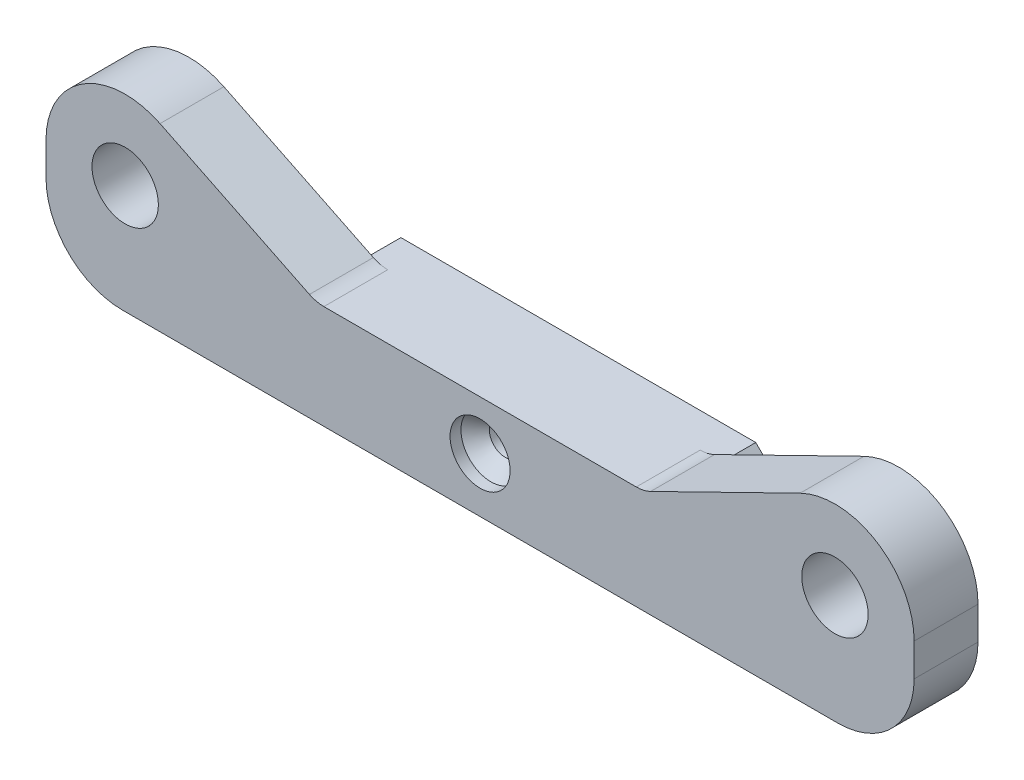
ISO-10303-21;
HEADER;
FILE_DESCRIPTION(('STEP AP214'),'2;1');
FILE_NAME('part.step','',(''),(''),'','','');
FILE_SCHEMA(('AUTOMOTIVE_DESIGN { 1 0 10303 214 1 1 1 1 }'));
ENDSEC;
DATA;
#1=APPLICATION_CONTEXT('core data for automotive mechanical design processes');
#2=APPLICATION_PROTOCOL_DEFINITION('international standard','automotive_design',2000,#1);
#3=PRODUCT_CONTEXT('',#1,'mechanical');
#4=PRODUCT('Part','Part','',(#3));
#5=PRODUCT_RELATED_PRODUCT_CATEGORY('part','',(#4));
#6=PRODUCT_DEFINITION_FORMATION('','',#4);
#7=PRODUCT_DEFINITION_CONTEXT('part definition',#1,'design');
#8=PRODUCT_DEFINITION('design','',#6,#7);
#9=PRODUCT_DEFINITION_SHAPE('','',#8);
#10=(LENGTH_UNIT() NAMED_UNIT(*) SI_UNIT(.MILLI.,.METRE.));
#11=(NAMED_UNIT(*) PLANE_ANGLE_UNIT() SI_UNIT($,.RADIAN.));
#12=(NAMED_UNIT(*) SI_UNIT($,.STERADIAN.) SOLID_ANGLE_UNIT());
#13=UNCERTAINTY_MEASURE_WITH_UNIT(LENGTH_MEASURE(1.E-05),#10,'distance_accuracy_value','');
#14=(GEOMETRIC_REPRESENTATION_CONTEXT(3) GLOBAL_UNCERTAINTY_ASSIGNED_CONTEXT((#13)) GLOBAL_UNIT_ASSIGNED_CONTEXT((#10,
#11,#12)) REPRESENTATION_CONTEXT('',''));
#15=CARTESIAN_POINT('',(0.,0.,0.));
#16=DIRECTION('',(0.,0.,1.));
#17=DIRECTION('',(1.,0.,0.));
#18=AXIS2_PLACEMENT_3D('',#15,#16,#17);
#19=CARTESIAN_POINT('',(-15.,0.,9.));
#20=DIRECTION('',(0.,0.,1.));
#21=DIRECTION('',(1.,0.,0.));
#22=AXIS2_PLACEMENT_3D('',#19,#20,#21);
#23=CYLINDRICAL_SURFACE('',#22,0.999999999999994);
#24=CARTESIAN_POINT('',(-15.,0.,0.));
#25=DIRECTION('',(0.,0.,-1.));
#26=DIRECTION('',(-1.,0.,0.));
#27=AXIS2_PLACEMENT_3D('',#24,#25,#26);
#28=CIRCLE('',#27,0.999999999999994);
#29=CARTESIAN_POINT('',(-16.,0.,0.));
#30=VERTEX_POINT('',#29);
#31=EDGE_CURVE('E260',#30,#30,#28,.T.);
#32=ORIENTED_EDGE('',*,*,#31,.T.);
#33=EDGE_LOOP('',(#32));
#34=FACE_BOUND('',#33,.T.);
#35=CARTESIAN_POINT('',(-15.,0.,7.));
#36=DIRECTION('',(0.,0.,1.));
#37=DIRECTION('',(1.,0.,0.));
#38=AXIS2_PLACEMENT_3D('',#35,#36,#37);
#39=CIRCLE('',#38,0.999999999999994);
#40=CARTESIAN_POINT('',(-14.,0.,7.));
#41=VERTEX_POINT('',#40);
#42=EDGE_CURVE('E457',#41,#41,#39,.F.);
#43=ORIENTED_EDGE('',*,*,#42,.F.);
#44=EDGE_LOOP('',(#43));
#45=FACE_BOUND('',#44,.T.);
#46=ADVANCED_FACE('F39',(#34,#45),#23,.F.);
#47=CARTESIAN_POINT('',(-32.5,5.,-17.3560966544099));
#48=DIRECTION('',(0.,0.,1.));
#49=DIRECTION('',(1.,0.,0.));
#50=AXIS2_PLACEMENT_3D('',#47,#48,#49);
#51=CYLINDRICAL_SURFACE('',#50,7.25000000000001);
#52=DIRECTION('',(0.,0.,-1.));
#53=VECTOR('',#52,1.);
#54=CARTESIAN_POINT('',(-39.75,4.99999999999995,19.0498756211209));
#55=LINE('',#54,#53);
#56=CARTESIAN_POINT('',(-39.75,4.99999999999995,9.));
#57=VERTEX_POINT('',#56);
#58=CARTESIAN_POINT('',(-39.75,4.99999999999995,3.15000000000003));
#59=VERTEX_POINT('',#58);
#60=EDGE_CURVE('E191',#57,#59,#55,.T.);
#61=ORIENTED_EDGE('',*,*,#60,.F.);
#62=CARTESIAN_POINT('',(-32.5,5.,9.));
#63=DIRECTION('',(0.,0.,1.));
#64=DIRECTION('',(1.,0.,0.));
#65=AXIS2_PLACEMENT_3D('',#62,#63,#64);
#66=CIRCLE('',#65,7.25000000000001);
#67=CARTESIAN_POINT('',(-29.3104090214584,11.5106842489562,9.));
#68=VERTEX_POINT('',#67);
#69=EDGE_CURVE('E204',#68,#57,#66,.T.);
#70=ORIENTED_EDGE('',*,*,#69,.F.);
#71=DIRECTION('',(0.,0.,-1.));
#72=VECTOR('',#71,1.);
#73=CARTESIAN_POINT('',(-29.3104090214584,11.5106842489562,24.9354165304833));
#74=LINE('',#73,#72);
#75=CARTESIAN_POINT('',(-29.3104090214584,11.5106842489562,3.15));
#76=VERTEX_POINT('',#75);
#77=EDGE_CURVE('E202',#68,#76,#74,.T.);
#78=ORIENTED_EDGE('',*,*,#77,.T.);
#79=CARTESIAN_POINT('',(-32.5,5.,3.15));
#80=DIRECTION('',(0.,0.,1.));
#81=DIRECTION('',(1.,0.,0.));
#82=AXIS2_PLACEMENT_3D('',#79,#80,#81);
#83=CIRCLE('',#82,7.25000000000001);
#84=EDGE_CURVE('E183',#59,#76,#83,.F.);
#85=ORIENTED_EDGE('',*,*,#84,.F.);
#86=EDGE_LOOP('',(#61,#70,#78,#85));
#87=FACE_BOUND('',#86,.T.);
#88=ADVANCED_FACE('F200',(#87),#51,.T.);
#89=CARTESIAN_POINT('',(38.75,-3.50000000000001,3.14999999999999));
#90=DIRECTION('',(0.,0.,1.));
#91=DIRECTION('',(1.,0.,0.));
#92=AXIS2_PLACEMENT_3D('',#89,#90,#91);
#93=PLANE('',#92);
#94=DIRECTION('',(0.,-1.,0.));
#95=VECTOR('',#94,1.);
#96=CARTESIAN_POINT('',(39.75,4.99999999999995,3.14999999999999));
#97=LINE('',#96,#95);
#98=CARTESIAN_POINT('',(39.75,4.99999999999999,3.15));
#99=VERTEX_POINT('',#98);
#100=CARTESIAN_POINT('',(39.75,2.,3.14999999999999));
#101=VERTEX_POINT('',#100);
#102=EDGE_CURVE('E197',#99,#101,#97,.T.);
#103=ORIENTED_EDGE('',*,*,#102,.T.);
#104=CARTESIAN_POINT('',(32.75,2.,3.14999999999999));
#105=DIRECTION('',(0.,0.,1.));
#106=DIRECTION('',(1.,0.,0.));
#107=AXIS2_PLACEMENT_3D('',#104,#105,#106);
#108=CIRCLE('',#107,7.);
#109=CARTESIAN_POINT('',(32.75,-5.,3.14999999999999));
#110=VERTEX_POINT('',#109);
#111=EDGE_CURVE('E12',#101,#110,#108,.F.);
#112=ORIENTED_EDGE('',*,*,#111,.T.);
#113=DIRECTION('',(1.,0.,0.));
#114=VECTOR('',#113,1.);
#115=CARTESIAN_POINT('',(18.75,-5.,3.15));
#116=LINE('',#115,#114);
#117=CARTESIAN_POINT('',(16.25,-5.,3.15));
#118=VERTEX_POINT('',#117);
#119=EDGE_CURVE('E374',#118,#110,#116,.T.);
#120=ORIENTED_EDGE('',*,*,#119,.F.);
#121=DIRECTION('',(0.707106781186546,0.707106781186549,0.));
#122=VECTOR('',#121,1.);
#123=CARTESIAN_POINT('',(28.2499999999999,7.,3.14999999999999));
#124=LINE('',#123,#122);
#125=CARTESIAN_POINT('',(18.75,-2.49999999999998,3.15));
#126=VERTEX_POINT('',#125);
#127=EDGE_CURVE('E387',#118,#126,#124,.T.);
#128=ORIENTED_EDGE('',*,*,#127,.T.);
#129=DIRECTION('',(0.,1.,0.));
#130=VECTOR('',#129,1.);
#131=CARTESIAN_POINT('',(18.75,-3.50000000000001,3.15));
#132=LINE('',#131,#130);
#133=CARTESIAN_POINT('',(18.75,2.,3.15));
#134=VERTEX_POINT('',#133);
#135=EDGE_CURVE('E404',#126,#134,#132,.T.);
#136=ORIENTED_EDGE('',*,*,#135,.T.);
#137=DIRECTION('',(-0.707106781186546,0.707106781186549,0.));
#138=VECTOR('',#137,1.);
#139=CARTESIAN_POINT('',(31.5,-10.75,3.14999999999999));
#140=LINE('',#139,#138);
#141=CARTESIAN_POINT('',(16.25,4.5,3.15000000000001));
#142=VERTEX_POINT('',#141);
#143=EDGE_CURVE('E396',#134,#142,#140,.T.);
#144=ORIENTED_EDGE('',*,*,#143,.T.);
#145=DIRECTION('',(-1.,0.,0.));
#146=VECTOR('',#145,1.);
#147=CARTESIAN_POINT('',(15.,4.5,3.15000000000001));
#148=LINE('',#147,#146);
#149=CARTESIAN_POINT('',(14.3046295691037,4.5,3.15000000000001));
#150=VERTEX_POINT('',#149);
#151=EDGE_CURVE('E303',#142,#150,#148,.T.);
#152=ORIENTED_EDGE('',*,*,#151,.T.);
#153=CARTESIAN_POINT('',(14.3046295691037,7.5,3.15));
#154=DIRECTION('',(0.,0.,1.));
#155=DIRECTION('',(1.,0.,0.));
#156=AXIS2_PLACEMENT_3D('',#153,#154,#155);
#157=CIRCLE('',#156,3.);
#158=CARTESIAN_POINT('',(15.624460318845,4.80592375905262,3.15000000000001));
#159=VERTEX_POINT('',#158);
#160=EDGE_CURVE('E289',#150,#159,#157,.T.);
#161=ORIENTED_EDGE('',*,*,#160,.T.);
#162=DIRECTION('',(0.898025413649127,0.439943583247118,0.));
#163=VECTOR('',#162,1.);
#164=CARTESIAN_POINT('',(29.3104090214584,11.5106842489562,3.15000000000002));
#165=LINE('',#164,#163);
#166=CARTESIAN_POINT('',(29.3104090214584,11.5106842489562,3.15000000000002));
#167=VERTEX_POINT('',#166);
#168=EDGE_CURVE('E299',#159,#167,#165,.T.);
#169=ORIENTED_EDGE('',*,*,#168,.T.);
#170=CARTESIAN_POINT('',(32.5,5.,3.15));
#171=DIRECTION('',(0.,0.,1.));
#172=DIRECTION('',(1.,0.,0.));
#173=AXIS2_PLACEMENT_3D('',#170,#171,#172);
#174=CIRCLE('',#173,7.25000000000001);
#175=EDGE_CURVE('E209',#167,#99,#174,.F.);
#176=ORIENTED_EDGE('',*,*,#175,.T.);
#177=EDGE_LOOP('',(#103,#112,#120,#128,#136,#144,#152,#161,#169,#176));
#178=FACE_BOUND('',#177,.T.);
#179=CARTESIAN_POINT('',(32.5,5.,3.14999999999999));
#180=DIRECTION('',(0.,0.,1.));
#181=DIRECTION('',(1.,0.,0.));
#182=AXIS2_PLACEMENT_3D('',#179,#180,#181);
#183=CIRCLE('',#182,3.04);
#184=CARTESIAN_POINT('',(35.54,5.,3.14999999999999));
#185=VERTEX_POINT('',#184);
#186=EDGE_CURVE('E408',#185,#185,#183,.F.);
#187=ORIENTED_EDGE('',*,*,#186,.F.);
#188=EDGE_LOOP('',(#187));
#189=FACE_BOUND('',#188,.T.);
#190=ADVANCED_FACE('F453',(#178,#189),#93,.F.);
#191=CARTESIAN_POINT('',(-38.75,3.49999999999999,9.));
#192=DIRECTION('',(0.,0.,1.));
#193=DIRECTION('',(1.,0.,0.));
#194=AXIS2_PLACEMENT_3D('',#191,#192,#193);
#195=PLANE('',#194);
#196=DIRECTION('',(0.,1.,0.));
#197=VECTOR('',#196,1.);
#198=CARTESIAN_POINT('',(-39.75,4.99999999999995,9.));
#199=LINE('',#198,#197);
#200=CARTESIAN_POINT('',(-39.75,2.,9.));
#201=VERTEX_POINT('',#200);
#202=EDGE_CURVE('E188',#201,#57,#199,.T.);
#203=ORIENTED_EDGE('',*,*,#202,.F.);
#204=CARTESIAN_POINT('',(-32.75,2.,9.));
#205=DIRECTION('',(0.,0.,1.));
#206=DIRECTION('',(1.,0.,0.));
#207=AXIS2_PLACEMENT_3D('',#204,#205,#206);
#208=CIRCLE('',#207,7.);
#209=CARTESIAN_POINT('',(-32.75,-5.,9.));
#210=VERTEX_POINT('',#209);
#211=EDGE_CURVE('E466',#201,#210,#208,.T.);
#212=ORIENTED_EDGE('',*,*,#211,.T.);
#213=DIRECTION('',(-1.,0.,0.));
#214=VECTOR('',#213,1.);
#215=CARTESIAN_POINT('',(38.75,-5.,9.));
#216=LINE('',#215,#214);
#217=CARTESIAN_POINT('',(32.75,-5.,9.));
#218=VERTEX_POINT('',#217);
#219=EDGE_CURVE('E249',#218,#210,#216,.T.);
#220=ORIENTED_EDGE('',*,*,#219,.F.);
#221=CARTESIAN_POINT('',(32.75,2.,9.));
#222=DIRECTION('',(0.,0.,1.));
#223=DIRECTION('',(1.,0.,0.));
#224=AXIS2_PLACEMENT_3D('',#221,#222,#223);
#225=CIRCLE('',#224,7.);
#226=CARTESIAN_POINT('',(39.75,2.,9.));
#227=VERTEX_POINT('',#226);
#228=EDGE_CURVE('E60',#218,#227,#225,.T.);
#229=ORIENTED_EDGE('',*,*,#228,.T.);
#230=DIRECTION('',(0.,-1.,0.));
#231=VECTOR('',#230,1.);
#232=CARTESIAN_POINT('',(39.75,4.99999999999995,9.));
#233=LINE('',#232,#231);
#234=CARTESIAN_POINT('',(39.75,4.99999999999995,9.));
#235=VERTEX_POINT('',#234);
#236=EDGE_CURVE('E321',#235,#227,#233,.T.);
#237=ORIENTED_EDGE('',*,*,#236,.F.);
#238=CARTESIAN_POINT('',(32.5,5.,9.));
#239=DIRECTION('',(0.,0.,1.));
#240=DIRECTION('',(-1.,0.,0.));
#241=AXIS2_PLACEMENT_3D('',#238,#239,#240);
#242=CIRCLE('',#241,7.25000000000001);
#243=CARTESIAN_POINT('',(29.3104090214584,11.5106842489562,9.));
#244=VERTEX_POINT('',#243);
#245=EDGE_CURVE('E212',#235,#244,#242,.T.);
#246=ORIENTED_EDGE('',*,*,#245,.T.);
#247=DIRECTION('',(0.898025413649127,0.439943583247118,0.));
#248=VECTOR('',#247,1.);
#249=CARTESIAN_POINT('',(29.3104090214584,11.5106842489562,9.));
#250=LINE('',#249,#248);
#251=CARTESIAN_POINT('',(15.624460318845,4.80592375905262,9.));
#252=VERTEX_POINT('',#251);
#253=EDGE_CURVE('E302',#252,#244,#250,.T.);
#254=ORIENTED_EDGE('',*,*,#253,.F.);
#255=CARTESIAN_POINT('',(14.3046295691037,7.5,9.));
#256=DIRECTION('',(0.,0.,1.));
#257=DIRECTION('',(1.,0.,0.));
#258=AXIS2_PLACEMENT_3D('',#255,#256,#257);
#259=CIRCLE('',#258,3.);
#260=CARTESIAN_POINT('',(14.3046295691037,4.5,9.));
#261=VERTEX_POINT('',#260);
#262=EDGE_CURVE('E292',#252,#261,#259,.F.);
#263=ORIENTED_EDGE('',*,*,#262,.T.);
#264=DIRECTION('',(1.,0.,0.));
#265=VECTOR('',#264,1.);
#266=CARTESIAN_POINT('',(-26.25,4.5,9.));
#267=LINE('',#266,#265);
#268=CARTESIAN_POINT('',(-14.3046295691037,4.5,9.));
#269=VERTEX_POINT('',#268);
#270=EDGE_CURVE('E207',#269,#261,#267,.T.);
#271=ORIENTED_EDGE('',*,*,#270,.F.);
#272=CARTESIAN_POINT('',(-14.3046295691037,7.5,9.));
#273=DIRECTION('',(0.,0.,1.));
#274=DIRECTION('',(1.,0.,0.));
#275=AXIS2_PLACEMENT_3D('',#272,#273,#274);
#276=CIRCLE('',#275,3.);
#277=CARTESIAN_POINT('',(-15.624460318845,4.80592375905261,9.));
#278=VERTEX_POINT('',#277);
#279=EDGE_CURVE('E351',#269,#278,#276,.F.);
#280=ORIENTED_EDGE('',*,*,#279,.T.);
#281=DIRECTION('',(0.898025413649127,-0.439943583247118,0.));
#282=VECTOR('',#281,1.);
#283=CARTESIAN_POINT('',(-29.3104090214584,11.5106842489562,9.));
#284=LINE('',#283,#282);
#285=EDGE_CURVE('E307',#68,#278,#284,.T.);
#286=ORIENTED_EDGE('',*,*,#285,.F.);
#287=ORIENTED_EDGE('',*,*,#69,.T.);
#288=EDGE_LOOP('',(#203,#212,#220,#229,#237,#246,#254,#263,#271,#280,#286,#287));
#289=FACE_BOUND('',#288,.T.);
#290=CARTESIAN_POINT('',(0.,0.,9.));
#291=DIRECTION('',(0.,0.,1.));
#292=DIRECTION('',(1.,0.,0.));
#293=AXIS2_PLACEMENT_3D('',#290,#291,#292);
#294=CIRCLE('',#293,2.75);
#295=CARTESIAN_POINT('',(2.75,0.,9.));
#296=VERTEX_POINT('',#295);
#297=EDGE_CURVE('E546',#296,#296,#294,.T.);
#298=ORIENTED_EDGE('',*,*,#297,.F.);
#299=EDGE_LOOP('',(#298));
#300=FACE_BOUND('',#299,.T.);
#301=CARTESIAN_POINT('',(-32.5,5.,9.));
#302=DIRECTION('',(0.,0.,1.));
#303=DIRECTION('',(1.,0.,0.));
#304=AXIS2_PLACEMENT_3D('',#301,#302,#303);
#305=CIRCLE('',#304,3.04);
#306=CARTESIAN_POINT('',(-29.46,5.,9.));
#307=VERTEX_POINT('',#306);
#308=EDGE_CURVE('E248',#307,#307,#305,.T.);
#309=ORIENTED_EDGE('',*,*,#308,.F.);
#310=EDGE_LOOP('',(#309));
#311=FACE_BOUND('',#310,.T.);
#312=CARTESIAN_POINT('',(32.5,5.,9.));
#313=DIRECTION('',(0.,0.,1.));
#314=DIRECTION('',(1.,0.,0.));
#315=AXIS2_PLACEMENT_3D('',#312,#313,#314);
#316=CIRCLE('',#315,3.04);
#317=CARTESIAN_POINT('',(35.54,5.,9.));
#318=VERTEX_POINT('',#317);
#319=EDGE_CURVE('E253',#318,#318,#316,.F.);
#320=ORIENTED_EDGE('',*,*,#319,.T.);
#321=EDGE_LOOP('',(#320));
#322=FACE_BOUND('',#321,.T.);
#323=ADVANCED_FACE('F318',(#289,#300,#311,#322),#195,.T.);
#324=CARTESIAN_POINT('',(-32.5,5.,22.));
#325=DIRECTION('',(0.,0.,-1.));
#326=DIRECTION('',(-1.,0.,0.));
#327=AXIS2_PLACEMENT_3D('',#324,#325,#326);
#328=CYLINDRICAL_SURFACE('',#327,3.04);
#329=CARTESIAN_POINT('',(-32.5,5.,3.15));
#330=DIRECTION('',(0.,0.,1.));
#331=DIRECTION('',(1.,0.,0.));
#332=AXIS2_PLACEMENT_3D('',#329,#330,#331);
#333=CIRCLE('',#332,3.04);
#334=CARTESIAN_POINT('',(-29.46,5.,3.15));
#335=VERTEX_POINT('',#334);
#336=EDGE_CURVE('E406',#335,#335,#333,.F.);
#337=ORIENTED_EDGE('',*,*,#336,.T.);
#338=EDGE_LOOP('',(#337));
#339=FACE_BOUND('',#338,.T.);
#340=ORIENTED_EDGE('',*,*,#308,.T.);
#341=EDGE_LOOP('',(#340));
#342=FACE_BOUND('',#341,.T.);
#343=ADVANCED_FACE('F501',(#339,#342),#328,.F.);
#344=CARTESIAN_POINT('',(32.5,5.,22.));
#345=DIRECTION('',(0.,0.,-1.));
#346=DIRECTION('',(-1.,0.,0.));
#347=AXIS2_PLACEMENT_3D('',#344,#345,#346);
#348=CYLINDRICAL_SURFACE('',#347,3.04);
#349=ORIENTED_EDGE('',*,*,#186,.T.);
#350=EDGE_LOOP('',(#349));
#351=FACE_BOUND('',#350,.T.);
#352=ORIENTED_EDGE('',*,*,#319,.F.);
#353=EDGE_LOOP('',(#352));
#354=FACE_BOUND('',#353,.T.);
#355=ADVANCED_FACE('F498',(#351,#354),#348,.F.);
#356=CARTESIAN_POINT('',(-38.75,-3.50000000000001,3.15));
#357=DIRECTION('',(0.,0.,1.));
#358=DIRECTION('',(1.,0.,0.));
#359=AXIS2_PLACEMENT_3D('',#356,#357,#358);
#360=PLANE('',#359);
#361=DIRECTION('',(1.,0.,0.));
#362=VECTOR('',#361,1.);
#363=CARTESIAN_POINT('',(-38.75,-5.00000000000001,3.15));
#364=LINE('',#363,#362);
#365=CARTESIAN_POINT('',(-32.75,-5.,3.15));
#366=VERTEX_POINT('',#365);
#367=CARTESIAN_POINT('',(-16.25,-5.,3.15));
#368=VERTEX_POINT('',#367);
#369=EDGE_CURVE('E244',#366,#368,#364,.T.);
#370=ORIENTED_EDGE('',*,*,#369,.F.);
#371=CARTESIAN_POINT('',(-32.75,2.,3.15));
#372=DIRECTION('',(0.,0.,1.));
#373=DIRECTION('',(1.,0.,0.));
#374=AXIS2_PLACEMENT_3D('',#371,#372,#373);
#375=CIRCLE('',#374,7.);
#376=CARTESIAN_POINT('',(-39.75,2.,3.15000000000003));
#377=VERTEX_POINT('',#376);
#378=EDGE_CURVE('E185',#366,#377,#375,.F.);
#379=ORIENTED_EDGE('',*,*,#378,.T.);
#380=DIRECTION('',(0.,1.,0.));
#381=VECTOR('',#380,1.);
#382=CARTESIAN_POINT('',(-39.75,4.99999999999995,3.15000000000003));
#383=LINE('',#382,#381);
#384=EDGE_CURVE('E176',#377,#59,#383,.T.);
#385=ORIENTED_EDGE('',*,*,#384,.T.);
#386=ORIENTED_EDGE('',*,*,#84,.T.);
#387=DIRECTION('',(0.898025413649127,-0.439943583247118,0.));
#388=VECTOR('',#387,1.);
#389=CARTESIAN_POINT('',(-29.3104090214584,11.5106842489562,3.14999999999999));
#390=LINE('',#389,#388);
#391=CARTESIAN_POINT('',(-15.624460318845,4.80592375905262,3.15));
#392=VERTEX_POINT('',#391);
#393=EDGE_CURVE('E340',#76,#392,#390,.T.);
#394=ORIENTED_EDGE('',*,*,#393,.T.);
#395=CARTESIAN_POINT('',(-14.3046295691037,7.5,3.15));
#396=DIRECTION('',(0.,0.,1.));
#397=DIRECTION('',(1.,0.,0.));
#398=AXIS2_PLACEMENT_3D('',#395,#396,#397);
#399=CIRCLE('',#398,3.);
#400=CARTESIAN_POINT('',(-14.3046295691037,4.5,3.15));
#401=VERTEX_POINT('',#400);
#402=EDGE_CURVE('E347',#392,#401,#399,.T.);
#403=ORIENTED_EDGE('',*,*,#402,.T.);
#404=DIRECTION('',(-1.,0.,0.));
#405=VECTOR('',#404,1.);
#406=CARTESIAN_POINT('',(-15.,4.5,3.15));
#407=LINE('',#406,#405);
#408=CARTESIAN_POINT('',(-16.25,4.5,3.15));
#409=VERTEX_POINT('',#408);
#410=EDGE_CURVE('E335',#401,#409,#407,.T.);
#411=ORIENTED_EDGE('',*,*,#410,.T.);
#412=DIRECTION('',(-0.707106781186546,-0.707106781186549,0.));
#413=VECTOR('',#412,1.);
#414=CARTESIAN_POINT('',(-31.5,-10.75,3.15));
#415=LINE('',#414,#413);
#416=CARTESIAN_POINT('',(-18.75,1.99999999999998,3.15));
#417=VERTEX_POINT('',#416);
#418=EDGE_CURVE('E390',#409,#417,#415,.T.);
#419=ORIENTED_EDGE('',*,*,#418,.T.);
#420=DIRECTION('',(0.,1.,0.));
#421=VECTOR('',#420,1.);
#422=CARTESIAN_POINT('',(-18.75,-3.50000000000001,3.15));
#423=LINE('',#422,#421);
#424=CARTESIAN_POINT('',(-18.75,-2.5,3.15));
#425=VERTEX_POINT('',#424);
#426=EDGE_CURVE('E400',#425,#417,#423,.T.);
#427=ORIENTED_EDGE('',*,*,#426,.F.);
#428=DIRECTION('',(0.707106781186546,-0.707106781186549,0.));
#429=VECTOR('',#428,1.);
#430=CARTESIAN_POINT('',(-28.25,6.99999999999998,3.15));
#431=LINE('',#430,#429);
#432=EDGE_CURVE('E391',#425,#368,#431,.T.);
#433=ORIENTED_EDGE('',*,*,#432,.T.);
#434=EDGE_LOOP('',(#370,#379,#385,#386,#394,#403,#411,#419,#427,#433));
#435=FACE_BOUND('',#434,.T.);
#436=ORIENTED_EDGE('',*,*,#336,.F.);
#437=EDGE_LOOP('',(#436));
#438=FACE_BOUND('',#437,.T.);
#439=ADVANCED_FACE('F179',(#435,#438),#360,.F.);
#440=CARTESIAN_POINT('',(-18.75,-3.50000000000001,-3.15));
#441=DIRECTION('',(1.,0.,0.));
#442=DIRECTION('',(0.,1.,0.));
#443=AXIS2_PLACEMENT_3D('',#440,#441,#442);
#444=PLANE('',#443);
#445=DIRECTION('',(0.,-1.,0.));
#446=VECTOR('',#445,1.);
#447=CARTESIAN_POINT('',(-18.75,-3.50000000000001,0.));
#448=LINE('',#447,#446);
#449=CARTESIAN_POINT('',(-18.75,1.99999999999998,0.));
#450=VERTEX_POINT('',#449);
#451=CARTESIAN_POINT('',(-18.75,-2.5,0.));
#452=VERTEX_POINT('',#451);
#453=EDGE_CURVE('E261',#450,#452,#448,.T.);
#454=ORIENTED_EDGE('',*,*,#453,.T.);
#455=DIRECTION('',(0.,0.,1.));
#456=VECTOR('',#455,1.);
#457=CARTESIAN_POINT('',(-18.75,-2.5,3.15));
#458=LINE('',#457,#456);
#459=EDGE_CURVE('E415',#452,#425,#458,.T.);
#460=ORIENTED_EDGE('',*,*,#459,.T.);
#461=ORIENTED_EDGE('',*,*,#426,.T.);
#462=DIRECTION('',(0.,0.,-1.));
#463=VECTOR('',#462,1.);
#464=CARTESIAN_POINT('',(-18.75,1.99999999999998,0.));
#465=LINE('',#464,#463);
#466=EDGE_CURVE('E418',#417,#450,#465,.T.);
#467=ORIENTED_EDGE('',*,*,#466,.T.);
#468=EDGE_LOOP('',(#454,#460,#461,#467));
#469=FACE_BOUND('',#468,.T.);
#470=ADVANCED_FACE('F414',(#469),#444,.F.);
#471=CARTESIAN_POINT('',(18.75,-3.50000000000001,-3.15));
#472=DIRECTION('',(-1.,0.,0.));
#473=DIRECTION('',(0.,-1.,0.));
#474=AXIS2_PLACEMENT_3D('',#471,#472,#473);
#475=PLANE('',#474);
#476=ORIENTED_EDGE('',*,*,#135,.F.);
#477=DIRECTION('',(0.,0.,-1.));
#478=VECTOR('',#477,1.);
#479=CARTESIAN_POINT('',(18.75,-2.49999999999998,0.));
#480=LINE('',#479,#478);
#481=CARTESIAN_POINT('',(18.75,-2.49999999999998,0.));
#482=VERTEX_POINT('',#481);
#483=EDGE_CURVE('E423',#126,#482,#480,.T.);
#484=ORIENTED_EDGE('',*,*,#483,.T.);
#485=DIRECTION('',(0.,-1.,0.));
#486=VECTOR('',#485,1.);
#487=CARTESIAN_POINT('',(18.75,-3.50000000000001,0.));
#488=LINE('',#487,#486);
#489=CARTESIAN_POINT('',(18.75,2.,0.));
#490=VERTEX_POINT('',#489);
#491=EDGE_CURVE('E276',#490,#482,#488,.T.);
#492=ORIENTED_EDGE('',*,*,#491,.F.);
#493=DIRECTION('',(0.,0.,1.));
#494=VECTOR('',#493,1.);
#495=CARTESIAN_POINT('',(18.75,2.,3.15));
#496=LINE('',#495,#494);
#497=EDGE_CURVE('E421',#490,#134,#496,.T.);
#498=ORIENTED_EDGE('',*,*,#497,.T.);
#499=EDGE_LOOP('',(#476,#484,#492,#498));
#500=FACE_BOUND('',#499,.T.);
#501=ADVANCED_FACE('F447',(#500),#475,.F.);
#502=CARTESIAN_POINT('',(15.,11.5,0.));
#503=DIRECTION('',(0.,0.,-1.));
#504=DIRECTION('',(-1.,0.,0.));
#505=AXIS2_PLACEMENT_3D('',#502,#503,#504);
#506=PLANE('',#505);
#507=CARTESIAN_POINT('',(0.,0.,0.));
#508=DIRECTION('',(0.,0.,1.));
#509=DIRECTION('',(1.,0.,0.));
#510=AXIS2_PLACEMENT_3D('',#507,#508,#509);
#511=CIRCLE('',#510,1.45);
#512=CARTESIAN_POINT('',(1.45,0.,0.));
#513=VERTEX_POINT('',#512);
#514=EDGE_CURVE('E375',#513,#513,#511,.T.);
#515=ORIENTED_EDGE('',*,*,#514,.T.);
#516=EDGE_LOOP('',(#515));
#517=FACE_BOUND('',#516,.T.);
#518=CARTESIAN_POINT('',(15.,0.,0.));
#519=DIRECTION('',(0.,0.,-1.));
#520=DIRECTION('',(-1.,0.,0.));
#521=AXIS2_PLACEMENT_3D('',#518,#519,#520);
#522=CIRCLE('',#521,0.999999999999997);
#523=CARTESIAN_POINT('',(14.,0.,0.));
#524=VERTEX_POINT('',#523);
#525=EDGE_CURVE('E256',#524,#524,#522,.T.);
#526=ORIENTED_EDGE('',*,*,#525,.F.);
#527=EDGE_LOOP('',(#526));
#528=FACE_BOUND('',#527,.T.);
#529=ORIENTED_EDGE('',*,*,#31,.F.);
#530=EDGE_LOOP('',(#529));
#531=FACE_BOUND('',#530,.T.);
#532=DIRECTION('',(1.,0.,0.));
#533=VECTOR('',#532,1.);
#534=CARTESIAN_POINT('',(-18.75,-5.,0.));
#535=LINE('',#534,#533);
#536=CARTESIAN_POINT('',(-16.25,-5.,0.));
#537=VERTEX_POINT('',#536);
#538=CARTESIAN_POINT('',(16.25,-5.,0.));
#539=VERTEX_POINT('',#538);
#540=EDGE_CURVE('E363',#537,#539,#535,.T.);
#541=ORIENTED_EDGE('',*,*,#540,.F.);
#542=DIRECTION('',(-0.707106781186546,0.707106781186549,0.));
#543=VECTOR('',#542,1.);
#544=CARTESIAN_POINT('',(-8.87500000000006,-12.375,0.));
#545=LINE('',#544,#543);
#546=EDGE_CURVE('E237',#537,#452,#545,.T.);
#547=ORIENTED_EDGE('',*,*,#546,.T.);
#548=ORIENTED_EDGE('',*,*,#453,.F.);
#549=DIRECTION('',(0.707106781186546,0.707106781186549,0.));
#550=VECTOR('',#549,1.);
#551=CARTESIAN_POINT('',(2.87499999999991,23.625,0.));
#552=LINE('',#551,#550);
#553=CARTESIAN_POINT('',(-16.25,4.5,0.));
#554=VERTEX_POINT('',#553);
#555=EDGE_CURVE('E229',#450,#554,#552,.T.);
#556=ORIENTED_EDGE('',*,*,#555,.T.);
#557=DIRECTION('',(-1.,0.,0.));
#558=VECTOR('',#557,1.);
#559=CARTESIAN_POINT('',(18.75,4.5,0.));
#560=LINE('',#559,#558);
#561=CARTESIAN_POINT('',(16.25,4.5,0.));
#562=VERTEX_POINT('',#561);
#563=EDGE_CURVE('E203',#562,#554,#560,.T.);
#564=ORIENTED_EDGE('',*,*,#563,.F.);
#565=DIRECTION('',(0.707106781186546,-0.707106781186549,0.));
#566=VECTOR('',#565,1.);
#567=CARTESIAN_POINT('',(12.125,8.62500000000002,0.));
#568=LINE('',#567,#566);
#569=EDGE_CURVE('E226',#562,#490,#568,.T.);
#570=ORIENTED_EDGE('',*,*,#569,.T.);
#571=ORIENTED_EDGE('',*,*,#491,.T.);
#572=DIRECTION('',(-0.707106781186546,-0.707106781186549,0.));
#573=VECTOR('',#572,1.);
#574=CARTESIAN_POINT('',(23.875,2.62500000000004,0.));
#575=LINE('',#574,#573);
#576=EDGE_CURVE('E234',#482,#539,#575,.T.);
#577=ORIENTED_EDGE('',*,*,#576,.T.);
#578=EDGE_LOOP('',(#541,#547,#548,#556,#564,#570,#571,#577));
#579=FACE_BOUND('',#578,.T.);
#580=ADVANCED_FACE('F369',(#517,#528,#531,#579),#506,.T.);
#581=CARTESIAN_POINT('',(15.,0.,9.));
#582=DIRECTION('',(0.,0.,1.));
#583=DIRECTION('',(1.,0.,0.));
#584=AXIS2_PLACEMENT_3D('',#581,#582,#583);
#585=CYLINDRICAL_SURFACE('',#584,0.999999999999997);
#586=CARTESIAN_POINT('',(15.,0.,7.));
#587=DIRECTION('',(0.,0.,1.));
#588=DIRECTION('',(-1.,0.,0.));
#589=AXIS2_PLACEMENT_3D('',#586,#587,#588);
#590=CIRCLE('',#589,0.999999999999996);
#591=CARTESIAN_POINT('',(14.,0.,7.));
#592=VERTEX_POINT('',#591);
#593=EDGE_CURVE('E332',#592,#592,#590,.T.);
#594=ORIENTED_EDGE('',*,*,#593,.T.);
#595=EDGE_LOOP('',(#594));
#596=FACE_BOUND('',#595,.T.);
#597=ORIENTED_EDGE('',*,*,#525,.T.);
#598=EDGE_LOOP('',(#597));
#599=FACE_BOUND('',#598,.T.);
#600=ADVANCED_FACE('F493',(#596,#599),#585,.F.);
#601=CARTESIAN_POINT('',(-18.75,-5.,0.));
#602=DIRECTION('',(0.,-1.,0.));
#603=DIRECTION('',(1.,0.,0.));
#604=AXIS2_PLACEMENT_3D('',#601,#602,#603);
#605=PLANE('',#604);
#606=ORIENTED_EDGE('',*,*,#219,.T.);
#607=DIRECTION('',(0.,0.,-1.));
#608=VECTOR('',#607,1.);
#609=CARTESIAN_POINT('',(-32.75,-5.,0.));
#610=LINE('',#609,#608);
#611=EDGE_CURVE('E456',#210,#366,#610,.T.);
#612=ORIENTED_EDGE('',*,*,#611,.T.);
#613=ORIENTED_EDGE('',*,*,#369,.T.);
#614=DIRECTION('',(0.,0.,-1.));
#615=VECTOR('',#614,1.);
#616=CARTESIAN_POINT('',(-16.25,-5.,0.));
#617=LINE('',#616,#615);
#618=EDGE_CURVE('E230',#368,#537,#617,.T.);
#619=ORIENTED_EDGE('',*,*,#618,.T.);
#620=ORIENTED_EDGE('',*,*,#540,.T.);
#621=DIRECTION('',(0.,0.,1.));
#622=VECTOR('',#621,1.);
#623=CARTESIAN_POINT('',(16.25,-5.,3.15));
#624=LINE('',#623,#622);
#625=EDGE_CURVE('E352',#539,#118,#624,.T.);
#626=ORIENTED_EDGE('',*,*,#625,.T.);
#627=ORIENTED_EDGE('',*,*,#119,.T.);
#628=DIRECTION('',(0.,0.,-1.));
#629=VECTOR('',#628,1.);
#630=CARTESIAN_POINT('',(32.75,-5.,0.));
#631=LINE('',#630,#629);
#632=EDGE_CURVE('E455',#110,#218,#631,.F.);
#633=ORIENTED_EDGE('',*,*,#632,.T.);
#634=EDGE_LOOP('',(#606,#612,#613,#619,#620,#626,#627,#633));
#635=FACE_BOUND('',#634,.T.);
#636=ADVANCED_FACE('F362',(#635),#605,.T.);
#637=CARTESIAN_POINT('',(0.,0.,9.));
#638=DIRECTION('',(0.,0.,1.));
#639=DIRECTION('',(1.,0.,0.));
#640=AXIS2_PLACEMENT_3D('',#637,#638,#639);
#641=CYLINDRICAL_SURFACE('',#640,1.45);
#642=ORIENTED_EDGE('',*,*,#514,.F.);
#643=EDGE_LOOP('',(#642));
#644=FACE_BOUND('',#643,.T.);
#645=CARTESIAN_POINT('',(0.,0.,6.7));
#646=DIRECTION('',(0.,0.,1.));
#647=DIRECTION('',(1.,0.,0.));
#648=AXIS2_PLACEMENT_3D('',#645,#646,#647);
#649=CIRCLE('',#648,1.45);
#650=CARTESIAN_POINT('',(1.45,0.,6.7));
#651=VERTEX_POINT('',#650);
#652=EDGE_CURVE('E377',#651,#651,#649,.T.);
#653=ORIENTED_EDGE('',*,*,#652,.T.);
#654=EDGE_LOOP('',(#653));
#655=FACE_BOUND('',#654,.T.);
#656=ADVANCED_FACE('F556',(#644,#655),#641,.F.);
#657=CARTESIAN_POINT('',(0.,0.,8.));
#658=DIRECTION('',(0.,0.,1.));
#659=DIRECTION('',(1.,0.,0.));
#660=AXIS2_PLACEMENT_3D('',#657,#658,#659);
#661=CONICAL_SURFACE('',#660,2.75,0.785398163397448);
#662=ORIENTED_EDGE('',*,*,#652,.F.);
#663=EDGE_LOOP('',(#662));
#664=FACE_BOUND('',#663,.T.);
#665=CARTESIAN_POINT('',(0.,0.,8.));
#666=DIRECTION('',(0.,0.,1.));
#667=DIRECTION('',(1.,0.,0.));
#668=AXIS2_PLACEMENT_3D('',#665,#666,#667);
#669=CIRCLE('',#668,2.75);
#670=CARTESIAN_POINT('',(2.75,0.,8.));
#671=VERTEX_POINT('',#670);
#672=EDGE_CURVE('E548',#671,#671,#669,.T.);
#673=ORIENTED_EDGE('',*,*,#672,.T.);
#674=EDGE_LOOP('',(#673));
#675=FACE_BOUND('',#674,.T.);
#676=ADVANCED_FACE('F558',(#664,#675),#661,.F.);
#677=CARTESIAN_POINT('',(0.,0.,9.));
#678=DIRECTION('',(0.,0.,1.));
#679=DIRECTION('',(1.,0.,0.));
#680=AXIS2_PLACEMENT_3D('',#677,#678,#679);
#681=CYLINDRICAL_SURFACE('',#680,2.75);
#682=ORIENTED_EDGE('',*,*,#672,.F.);
#683=EDGE_LOOP('',(#682));
#684=FACE_BOUND('',#683,.T.);
#685=ORIENTED_EDGE('',*,*,#297,.T.);
#686=EDGE_LOOP('',(#685));
#687=FACE_BOUND('',#686,.T.);
#688=ADVANCED_FACE('F561',(#684,#687),#681,.F.);
#689=CARTESIAN_POINT('',(18.75,4.5,0.));
#690=DIRECTION('',(0.,1.,0.));
#691=DIRECTION('',(-1.,0.,0.));
#692=AXIS2_PLACEMENT_3D('',#689,#690,#691);
#693=PLANE('',#692);
#694=ORIENTED_EDGE('',*,*,#563,.T.);
#695=DIRECTION('',(0.,0.,1.));
#696=VECTOR('',#695,1.);
#697=CARTESIAN_POINT('',(-16.25,4.5,3.14999999999999));
#698=LINE('',#697,#696);
#699=EDGE_CURVE('E429',#554,#409,#698,.T.);
#700=ORIENTED_EDGE('',*,*,#699,.T.);
#701=ORIENTED_EDGE('',*,*,#410,.F.);
#702=DIRECTION('',(0.,0.,-1.));
#703=VECTOR('',#702,1.);
#704=CARTESIAN_POINT('',(-14.3046295691037,4.5,9.));
#705=LINE('',#704,#703);
#706=EDGE_CURVE('E279',#401,#269,#705,.F.);
#707=ORIENTED_EDGE('',*,*,#706,.T.);
#708=ORIENTED_EDGE('',*,*,#270,.T.);
#709=DIRECTION('',(0.,0.,-1.));
#710=VECTOR('',#709,1.);
#711=CARTESIAN_POINT('',(14.3046295691037,4.5,3.15000000000001));
#712=LINE('',#711,#710);
#713=EDGE_CURVE('E281',#261,#150,#712,.T.);
#714=ORIENTED_EDGE('',*,*,#713,.T.);
#715=ORIENTED_EDGE('',*,*,#151,.F.);
#716=DIRECTION('',(0.,0.,-1.));
#717=VECTOR('',#716,1.);
#718=CARTESIAN_POINT('',(16.25,4.5,0.));
#719=LINE('',#718,#717);
#720=EDGE_CURVE('E427',#142,#562,#719,.T.);
#721=ORIENTED_EDGE('',*,*,#720,.T.);
#722=EDGE_LOOP('',(#694,#700,#701,#707,#708,#714,#715,#721));
#723=FACE_BOUND('',#722,.T.);
#724=ADVANCED_FACE('F437',(#723),#693,.T.);
#725=CARTESIAN_POINT('',(32.5,5.,-17.3560966544099));
#726=DIRECTION('',(0.,0.,1.));
#727=DIRECTION('',(1.,0.,0.));
#728=AXIS2_PLACEMENT_3D('',#725,#726,#727);
#729=CYLINDRICAL_SURFACE('',#728,7.25000000000001);
#730=DIRECTION('',(0.,0.,-1.));
#731=VECTOR('',#730,1.);
#732=CARTESIAN_POINT('',(39.75,4.99999999999995,19.0498756211208));
#733=LINE('',#732,#731);
#734=EDGE_CURVE('E330',#235,#99,#733,.T.);
#735=ORIENTED_EDGE('',*,*,#734,.T.);
#736=ORIENTED_EDGE('',*,*,#175,.F.);
#737=DIRECTION('',(0.,0.,-1.));
#738=VECTOR('',#737,1.);
#739=CARTESIAN_POINT('',(29.3104090214584,11.5106842489562,24.9354165304833));
#740=LINE('',#739,#738);
#741=EDGE_CURVE('E310',#244,#167,#740,.T.);
#742=ORIENTED_EDGE('',*,*,#741,.F.);
#743=ORIENTED_EDGE('',*,*,#245,.F.);
#744=EDGE_LOOP('',(#735,#736,#742,#743));
#745=FACE_BOUND('',#744,.T.);
#746=ADVANCED_FACE('F329',(#745),#729,.T.);
#747=CARTESIAN_POINT('',(29.3104090214584,11.5106842489562,24.9354165304833));
#748=DIRECTION('',(-0.439943583247118,0.898025413649127,0.));
#749=DIRECTION('',(-0.898025413649127,-0.439943583247118,0.));
#750=AXIS2_PLACEMENT_3D('',#747,#748,#749);
#751=PLANE('',#750);
#752=ORIENTED_EDGE('',*,*,#168,.F.);
#753=DIRECTION('',(0.,0.,-1.));
#754=VECTOR('',#753,1.);
#755=CARTESIAN_POINT('',(15.624460318845,4.80592375905262,9.));
#756=LINE('',#755,#754);
#757=EDGE_CURVE('E284',#159,#252,#756,.F.);
#758=ORIENTED_EDGE('',*,*,#757,.T.);
#759=ORIENTED_EDGE('',*,*,#253,.T.);
#760=ORIENTED_EDGE('',*,*,#741,.T.);
#761=EDGE_LOOP('',(#752,#758,#759,#760));
#762=FACE_BOUND('',#761,.T.);
#763=ADVANCED_FACE('F327',(#762),#751,.T.);
#764=CARTESIAN_POINT('',(-29.3104090214584,11.5106842489562,24.9354165304833));
#765=DIRECTION('',(0.439943583247118,0.898025413649127,0.));
#766=DIRECTION('',(-0.898025413649127,0.439943583247118,0.));
#767=AXIS2_PLACEMENT_3D('',#764,#765,#766);
#768=PLANE('',#767);
#769=ORIENTED_EDGE('',*,*,#285,.T.);
#770=DIRECTION('',(0.,0.,-1.));
#771=VECTOR('',#770,1.);
#772=CARTESIAN_POINT('',(-15.624460318845,4.80592375905262,3.15));
#773=LINE('',#772,#771);
#774=EDGE_CURVE('E286',#278,#392,#773,.T.);
#775=ORIENTED_EDGE('',*,*,#774,.T.);
#776=ORIENTED_EDGE('',*,*,#393,.F.);
#777=ORIENTED_EDGE('',*,*,#77,.F.);
#778=EDGE_LOOP('',(#769,#775,#776,#777));
#779=FACE_BOUND('',#778,.T.);
#780=ADVANCED_FACE('F519',(#779),#768,.T.);
#781=CARTESIAN_POINT('',(14.3046295691037,7.5,0.));
#782=DIRECTION('',(0.,0.,1.));
#783=DIRECTION('',(1.,0.,0.));
#784=AXIS2_PLACEMENT_3D('',#781,#782,#783);
#785=CYLINDRICAL_SURFACE('',#784,3.);
#786=ORIENTED_EDGE('',*,*,#262,.F.);
#787=ORIENTED_EDGE('',*,*,#757,.F.);
#788=ORIENTED_EDGE('',*,*,#160,.F.);
#789=ORIENTED_EDGE('',*,*,#713,.F.);
#790=EDGE_LOOP('',(#786,#787,#788,#789));
#791=FACE_BOUND('',#790,.T.);
#792=ADVANCED_FACE('F515',(#791),#785,.F.);
#793=CARTESIAN_POINT('',(-14.3046295691037,7.5,24.9354165304833));
#794=DIRECTION('',(0.,0.,1.));
#795=DIRECTION('',(1.,0.,0.));
#796=AXIS2_PLACEMENT_3D('',#793,#794,#795);
#797=CYLINDRICAL_SURFACE('',#796,3.);
#798=ORIENTED_EDGE('',*,*,#279,.F.);
#799=ORIENTED_EDGE('',*,*,#706,.F.);
#800=ORIENTED_EDGE('',*,*,#402,.F.);
#801=ORIENTED_EDGE('',*,*,#774,.F.);
#802=EDGE_LOOP('',(#798,#799,#800,#801));
#803=FACE_BOUND('',#802,.T.);
#804=ADVANCED_FACE('F518',(#803),#797,.F.);
#805=CARTESIAN_POINT('',(-16.25,-5.,0.));
#806=DIRECTION('',(-0.707106781186549,-0.707106781186546,0.));
#807=DIRECTION('',(0.707106781186546,-0.707106781186549,0.));
#808=AXIS2_PLACEMENT_3D('',#805,#806,#807);
#809=PLANE('',#808);
#810=ORIENTED_EDGE('',*,*,#432,.F.);
#811=ORIENTED_EDGE('',*,*,#459,.F.);
#812=ORIENTED_EDGE('',*,*,#546,.F.);
#813=ORIENTED_EDGE('',*,*,#618,.F.);
#814=EDGE_LOOP('',(#810,#811,#812,#813));
#815=FACE_BOUND('',#814,.T.);
#816=ADVANCED_FACE('F420',(#815),#809,.T.);
#817=CARTESIAN_POINT('',(16.25,-5.,0.));
#818=DIRECTION('',(0.707106781186549,-0.707106781186546,0.));
#819=DIRECTION('',(0.707106781186546,0.707106781186549,0.));
#820=AXIS2_PLACEMENT_3D('',#817,#818,#819);
#821=PLANE('',#820);
#822=ORIENTED_EDGE('',*,*,#576,.F.);
#823=ORIENTED_EDGE('',*,*,#483,.F.);
#824=ORIENTED_EDGE('',*,*,#127,.F.);
#825=ORIENTED_EDGE('',*,*,#625,.F.);
#826=EDGE_LOOP('',(#822,#823,#824,#825));
#827=FACE_BOUND('',#826,.T.);
#828=ADVANCED_FACE('F452',(#827),#821,.T.);
#829=CARTESIAN_POINT('',(-16.25,4.5,0.));
#830=DIRECTION('',(-0.707106781186549,0.707106781186546,0.));
#831=DIRECTION('',(-0.707106781186546,-0.707106781186549,0.));
#832=AXIS2_PLACEMENT_3D('',#829,#830,#831);
#833=PLANE('',#832);
#834=ORIENTED_EDGE('',*,*,#555,.F.);
#835=ORIENTED_EDGE('',*,*,#466,.F.);
#836=ORIENTED_EDGE('',*,*,#418,.F.);
#837=ORIENTED_EDGE('',*,*,#699,.F.);
#838=EDGE_LOOP('',(#834,#835,#836,#837));
#839=FACE_BOUND('',#838,.T.);
#840=ADVANCED_FACE('F435',(#839),#833,.T.);
#841=CARTESIAN_POINT('',(16.25,4.5,0.));
#842=DIRECTION('',(0.707106781186549,0.707106781186546,0.));
#843=DIRECTION('',(-0.707106781186546,0.707106781186549,0.));
#844=AXIS2_PLACEMENT_3D('',#841,#842,#843);
#845=PLANE('',#844);
#846=ORIENTED_EDGE('',*,*,#143,.F.);
#847=ORIENTED_EDGE('',*,*,#497,.F.);
#848=ORIENTED_EDGE('',*,*,#569,.F.);
#849=ORIENTED_EDGE('',*,*,#720,.F.);
#850=EDGE_LOOP('',(#846,#847,#848,#849));
#851=FACE_BOUND('',#850,.T.);
#852=ADVANCED_FACE('F442',(#851),#845,.T.);
#853=CARTESIAN_POINT('',(-15.,0.,7.));
#854=DIRECTION('',(0.,0.,1.));
#855=DIRECTION('',(1.,0.,0.));
#856=AXIS2_PLACEMENT_3D('',#853,#854,#855);
#857=PLANE('',#856);
#858=ORIENTED_EDGE('',*,*,#42,.T.);
#859=EDGE_LOOP('',(#858));
#860=FACE_BOUND('',#859,.T.);
#861=ADVANCED_FACE('F480',(#860),#857,.F.);
#862=CARTESIAN_POINT('',(15.,0.,7.));
#863=DIRECTION('',(0.,0.,-1.));
#864=DIRECTION('',(-1.,0.,0.));
#865=AXIS2_PLACEMENT_3D('',#862,#863,#864);
#866=PLANE('',#865);
#867=ORIENTED_EDGE('',*,*,#593,.F.);
#868=EDGE_LOOP('',(#867));
#869=FACE_BOUND('',#868,.T.);
#870=ADVANCED_FACE('F472',(#869),#866,.T.);
#871=CARTESIAN_POINT('',(39.75,4.99999999999995,19.0498756211208));
#872=DIRECTION('',(1.,0.,0.));
#873=DIRECTION('',(0.,0.,-1.));
#874=AXIS2_PLACEMENT_3D('',#871,#872,#873);
#875=PLANE('',#874);
#876=ORIENTED_EDGE('',*,*,#236,.T.);
#877=DIRECTION('',(0.,0.,-1.));
#878=VECTOR('',#877,1.);
#879=CARTESIAN_POINT('',(39.75,2.,19.0498756211208));
#880=LINE('',#879,#878);
#881=EDGE_CURVE('E47',#227,#101,#880,.T.);
#882=ORIENTED_EDGE('',*,*,#881,.T.);
#883=ORIENTED_EDGE('',*,*,#102,.F.);
#884=ORIENTED_EDGE('',*,*,#734,.F.);
#885=EDGE_LOOP('',(#876,#882,#883,#884));
#886=FACE_BOUND('',#885,.T.);
#887=ADVANCED_FACE('F467',(#886),#875,.T.);
#888=CARTESIAN_POINT('',(-39.75,4.99999999999995,19.0498756211209));
#889=DIRECTION('',(-1.,0.,0.));
#890=DIRECTION('',(0.,0.,1.));
#891=AXIS2_PLACEMENT_3D('',#888,#889,#890);
#892=PLANE('',#891);
#893=ORIENTED_EDGE('',*,*,#384,.F.);
#894=DIRECTION('',(0.,0.,-1.));
#895=VECTOR('',#894,1.);
#896=CARTESIAN_POINT('',(-39.75,2.,19.0498756211209));
#897=LINE('',#896,#895);
#898=EDGE_CURVE('E463',#377,#201,#897,.F.);
#899=ORIENTED_EDGE('',*,*,#898,.T.);
#900=ORIENTED_EDGE('',*,*,#202,.T.);
#901=ORIENTED_EDGE('',*,*,#60,.T.);
#902=EDGE_LOOP('',(#893,#899,#900,#901));
#903=FACE_BOUND('',#902,.T.);
#904=ADVANCED_FACE('F192',(#903),#892,.T.);
#905=CARTESIAN_POINT('',(-32.75,2.,0.));
#906=DIRECTION('',(0.,0.,-1.));
#907=DIRECTION('',(-1.,0.,0.));
#908=AXIS2_PLACEMENT_3D('',#905,#906,#907);
#909=CYLINDRICAL_SURFACE('',#908,7.);
#910=ORIENTED_EDGE('',*,*,#211,.F.);
#911=ORIENTED_EDGE('',*,*,#898,.F.);
#912=ORIENTED_EDGE('',*,*,#378,.F.);
#913=ORIENTED_EDGE('',*,*,#611,.F.);
#914=EDGE_LOOP('',(#910,#911,#912,#913));
#915=FACE_BOUND('',#914,.T.);
#916=ADVANCED_FACE('F478',(#915),#909,.T.);
#917=CARTESIAN_POINT('',(32.75,2.,19.0498756211208));
#918=DIRECTION('',(0.,0.,-1.));
#919=DIRECTION('',(-1.,0.,0.));
#920=AXIS2_PLACEMENT_3D('',#917,#918,#919);
#921=CYLINDRICAL_SURFACE('',#920,7.);
#922=ORIENTED_EDGE('',*,*,#228,.F.);
#923=ORIENTED_EDGE('',*,*,#632,.F.);
#924=ORIENTED_EDGE('',*,*,#111,.F.);
#925=ORIENTED_EDGE('',*,*,#881,.F.);
#926=EDGE_LOOP('',(#922,#923,#924,#925));
#927=FACE_BOUND('',#926,.T.);
#928=ADVANCED_FACE('F41',(#927),#921,.T.);
#929=CLOSED_SHELL('',(#46,#88,#190,#323,#343,#355,#439,#470,#501,#580,#600,#636,#656,#676,#688,
#724,#746,#763,#780,#792,#804,#816,#828,#840,#852,#861,#870,#887,#904,#916,#928));
#930=MANIFOLD_SOLID_BREP('B2',#929);
#931=ADVANCED_BREP_SHAPE_REPRESENTATION('',(#18,#930),#14);
#932=SHAPE_DEFINITION_REPRESENTATION(#9,#931);
ENDSEC;
END-ISO-10303-21;
